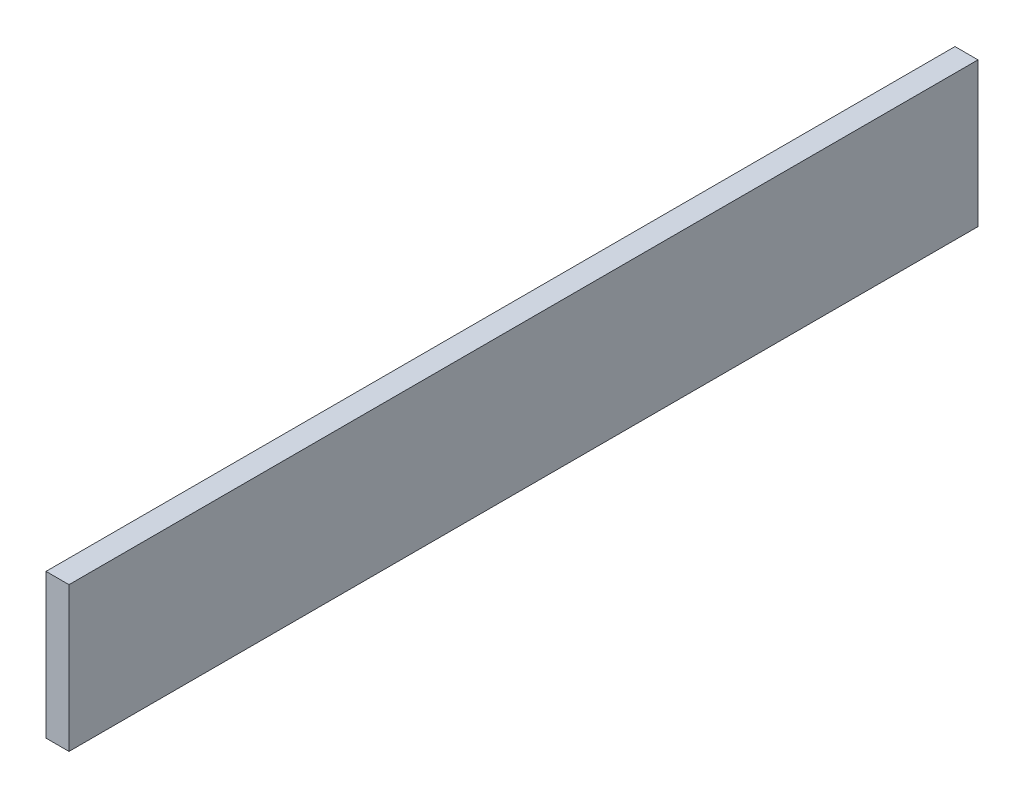
ISO-10303-21;
HEADER;
FILE_DESCRIPTION(('STEP AP214'),'2;1');
FILE_NAME('part.step','',(''),(''),'','','');
FILE_SCHEMA(('AUTOMOTIVE_DESIGN { 1 0 10303 214 1 1 1 1 }'));
ENDSEC;
DATA;
#1=APPLICATION_CONTEXT('core data for automotive mechanical design processes');
#2=APPLICATION_PROTOCOL_DEFINITION('international standard','automotive_design',2000,#1);
#3=PRODUCT_CONTEXT('',#1,'mechanical');
#4=PRODUCT('Part','Part','',(#3));
#5=PRODUCT_RELATED_PRODUCT_CATEGORY('part','',(#4));
#6=PRODUCT_DEFINITION_FORMATION('','',#4);
#7=PRODUCT_DEFINITION_CONTEXT('part definition',#1,'design');
#8=PRODUCT_DEFINITION('design','',#6,#7);
#9=PRODUCT_DEFINITION_SHAPE('','',#8);
#10=(LENGTH_UNIT() NAMED_UNIT(*) SI_UNIT(.MILLI.,.METRE.));
#11=(NAMED_UNIT(*) PLANE_ANGLE_UNIT() SI_UNIT($,.RADIAN.));
#12=(NAMED_UNIT(*) SI_UNIT($,.STERADIAN.) SOLID_ANGLE_UNIT());
#13=UNCERTAINTY_MEASURE_WITH_UNIT(LENGTH_MEASURE(1.E-05),#10,'distance_accuracy_value','');
#14=(GEOMETRIC_REPRESENTATION_CONTEXT(3) GLOBAL_UNCERTAINTY_ASSIGNED_CONTEXT((#13)) GLOBAL_UNIT_ASSIGNED_CONTEXT((#10,
#11,#12)) REPRESENTATION_CONTEXT('',''));
#15=CARTESIAN_POINT('',(0.,0.,0.));
#16=DIRECTION('',(0.,0.,1.));
#17=DIRECTION('',(1.,0.,0.));
#18=AXIS2_PLACEMENT_3D('',#15,#16,#17);
#19=CARTESIAN_POINT('',(6.35,-19.939,-125.476));
#20=DIRECTION('',(0.,0.,1.));
#21=DIRECTION('',(1.,0.,0.));
#22=AXIS2_PLACEMENT_3D('',#19,#20,#21);
#23=PLANE('',#22);
#24=DIRECTION('',(0.,1.,0.));
#25=VECTOR('',#24,1.);
#26=CARTESIAN_POINT('',(0.,-19.939,-125.476));
#27=LINE('',#26,#25);
#28=CARTESIAN_POINT('',(0.,-19.939,-125.476));
#29=VERTEX_POINT('',#28);
#30=CARTESIAN_POINT('',(0.,19.939,-125.476));
#31=VERTEX_POINT('',#30);
#32=EDGE_CURVE('E117',#29,#31,#27,.T.);
#33=ORIENTED_EDGE('',*,*,#32,.T.);
#34=DIRECTION('',(-1.,0.,0.));
#35=VECTOR('',#34,1.);
#36=CARTESIAN_POINT('',(6.35,19.939,-125.476));
#37=LINE('',#36,#35);
#38=CARTESIAN_POINT('',(6.35,19.939,-125.476));
#39=VERTEX_POINT('',#38);
#40=EDGE_CURVE('E11',#39,#31,#37,.T.);
#41=ORIENTED_EDGE('',*,*,#40,.F.);
#42=DIRECTION('',(0.,1.,0.));
#43=VECTOR('',#42,1.);
#44=CARTESIAN_POINT('',(6.35,-19.939,-125.476));
#45=LINE('',#44,#43);
#46=CARTESIAN_POINT('',(6.35,-19.939,-125.476));
#47=VERTEX_POINT('',#46);
#48=EDGE_CURVE('E103',#47,#39,#45,.T.);
#49=ORIENTED_EDGE('',*,*,#48,.F.);
#50=DIRECTION('',(-1.,0.,0.));
#51=VECTOR('',#50,1.);
#52=CARTESIAN_POINT('',(6.35,-19.939,-125.476));
#53=LINE('',#52,#51);
#54=EDGE_CURVE('E113',#47,#29,#53,.T.);
#55=ORIENTED_EDGE('',*,*,#54,.T.);
#56=EDGE_LOOP('',(#33,#41,#49,#55));
#57=FACE_BOUND('',#56,.T.);
#58=ADVANCED_FACE('F47',(#57),#23,.F.);
#59=CARTESIAN_POINT('',(6.35,19.939,125.476));
#60=DIRECTION('',(0.,-1.,0.));
#61=DIRECTION('',(0.,0.,-1.));
#62=AXIS2_PLACEMENT_3D('',#59,#60,#61);
#63=PLANE('',#62);
#64=DIRECTION('',(0.,0.,1.));
#65=VECTOR('',#64,1.);
#66=CARTESIAN_POINT('',(0.,19.939,125.476));
#67=LINE('',#66,#65);
#68=CARTESIAN_POINT('',(0.,19.939,125.476));
#69=VERTEX_POINT('',#68);
#70=EDGE_CURVE('E108',#31,#69,#67,.T.);
#71=ORIENTED_EDGE('',*,*,#70,.T.);
#72=DIRECTION('',(-1.,0.,0.));
#73=VECTOR('',#72,1.);
#74=CARTESIAN_POINT('',(6.35,19.939,125.476));
#75=LINE('',#74,#73);
#76=CARTESIAN_POINT('',(6.35,19.939,125.476));
#77=VERTEX_POINT('',#76);
#78=EDGE_CURVE('E56',#77,#69,#75,.T.);
#79=ORIENTED_EDGE('',*,*,#78,.F.);
#80=DIRECTION('',(0.,0.,1.));
#81=VECTOR('',#80,1.);
#82=CARTESIAN_POINT('',(6.35,19.939,125.476));
#83=LINE('',#82,#81);
#84=EDGE_CURVE('E98',#39,#77,#83,.T.);
#85=ORIENTED_EDGE('',*,*,#84,.F.);
#86=ORIENTED_EDGE('',*,*,#40,.T.);
#87=EDGE_LOOP('',(#71,#79,#85,#86));
#88=FACE_BOUND('',#87,.T.);
#89=ADVANCED_FACE('F107',(#88),#63,.F.);
#90=CARTESIAN_POINT('',(6.35,-19.939,125.476));
#91=DIRECTION('',(0.,0.,-1.));
#92=DIRECTION('',(-1.,0.,0.));
#93=AXIS2_PLACEMENT_3D('',#90,#91,#92);
#94=PLANE('',#93);
#95=DIRECTION('',(0.,-1.,0.));
#96=VECTOR('',#95,1.);
#97=CARTESIAN_POINT('',(0.,-19.939,125.476));
#98=LINE('',#97,#96);
#99=CARTESIAN_POINT('',(0.,-19.939,125.476));
#100=VERTEX_POINT('',#99);
#101=EDGE_CURVE('E84',#69,#100,#98,.T.);
#102=ORIENTED_EDGE('',*,*,#101,.T.);
#103=DIRECTION('',(-1.,0.,0.));
#104=VECTOR('',#103,1.);
#105=CARTESIAN_POINT('',(6.35,-19.939,125.476));
#106=LINE('',#105,#104);
#107=CARTESIAN_POINT('',(6.35,-19.939,125.476));
#108=VERTEX_POINT('',#107);
#109=EDGE_CURVE('E109',#108,#100,#106,.T.);
#110=ORIENTED_EDGE('',*,*,#109,.F.);
#111=DIRECTION('',(0.,-1.,0.));
#112=VECTOR('',#111,1.);
#113=CARTESIAN_POINT('',(6.35,-19.939,125.476));
#114=LINE('',#113,#112);
#115=EDGE_CURVE('E101',#77,#108,#114,.T.);
#116=ORIENTED_EDGE('',*,*,#115,.F.);
#117=ORIENTED_EDGE('',*,*,#78,.T.);
#118=EDGE_LOOP('',(#102,#110,#116,#117));
#119=FACE_BOUND('',#118,.T.);
#120=ADVANCED_FACE('F110',(#119),#94,.F.);
#121=CARTESIAN_POINT('',(6.35,-19.939,125.476));
#122=DIRECTION('',(0.,1.,0.));
#123=DIRECTION('',(0.,0.,1.));
#124=AXIS2_PLACEMENT_3D('',#121,#122,#123);
#125=PLANE('',#124);
#126=DIRECTION('',(0.,0.,-1.));
#127=VECTOR('',#126,1.);
#128=CARTESIAN_POINT('',(0.,-19.939,125.476));
#129=LINE('',#128,#127);
#130=EDGE_CURVE('E91',#100,#29,#129,.T.);
#131=ORIENTED_EDGE('',*,*,#130,.T.);
#132=ORIENTED_EDGE('',*,*,#54,.F.);
#133=DIRECTION('',(0.,0.,-1.));
#134=VECTOR('',#133,1.);
#135=CARTESIAN_POINT('',(6.35,-19.939,125.476));
#136=LINE('',#135,#134);
#137=EDGE_CURVE('E66',#108,#47,#136,.T.);
#138=ORIENTED_EDGE('',*,*,#137,.F.);
#139=ORIENTED_EDGE('',*,*,#109,.T.);
#140=EDGE_LOOP('',(#131,#132,#138,#139));
#141=FACE_BOUND('',#140,.T.);
#142=ADVANCED_FACE('F128',(#141),#125,.F.);
#143=CARTESIAN_POINT('',(6.35,0.,0.));
#144=DIRECTION('',(-1.,0.,0.));
#145=DIRECTION('',(0.,0.,1.));
#146=AXIS2_PLACEMENT_3D('',#143,#144,#145);
#147=PLANE('',#146);
#148=ORIENTED_EDGE('',*,*,#48,.T.);
#149=ORIENTED_EDGE('',*,*,#84,.T.);
#150=ORIENTED_EDGE('',*,*,#115,.T.);
#151=ORIENTED_EDGE('',*,*,#137,.T.);
#152=EDGE_LOOP('',(#148,#149,#150,#151));
#153=FACE_BOUND('',#152,.T.);
#154=ADVANCED_FACE('F99',(#153),#147,.F.);
#155=CARTESIAN_POINT('',(0.,0.,0.));
#156=DIRECTION('',(-1.,0.,0.));
#157=DIRECTION('',(0.,0.,1.));
#158=AXIS2_PLACEMENT_3D('',#155,#156,#157);
#159=PLANE('',#158);
#160=ORIENTED_EDGE('',*,*,#32,.F.);
#161=ORIENTED_EDGE('',*,*,#130,.F.);
#162=ORIENTED_EDGE('',*,*,#101,.F.);
#163=ORIENTED_EDGE('',*,*,#70,.F.);
#164=EDGE_LOOP('',(#160,#161,#162,#163));
#165=FACE_BOUND('',#164,.T.);
#166=ADVANCED_FACE('F131',(#165),#159,.T.);
#167=CLOSED_SHELL('',(#58,#89,#120,#142,#154,#166));
#168=MANIFOLD_SOLID_BREP('B2',#167);
#169=ADVANCED_BREP_SHAPE_REPRESENTATION('',(#18,#168),#14);
#170=SHAPE_DEFINITION_REPRESENTATION(#9,#169);
ENDSEC;
END-ISO-10303-21;
